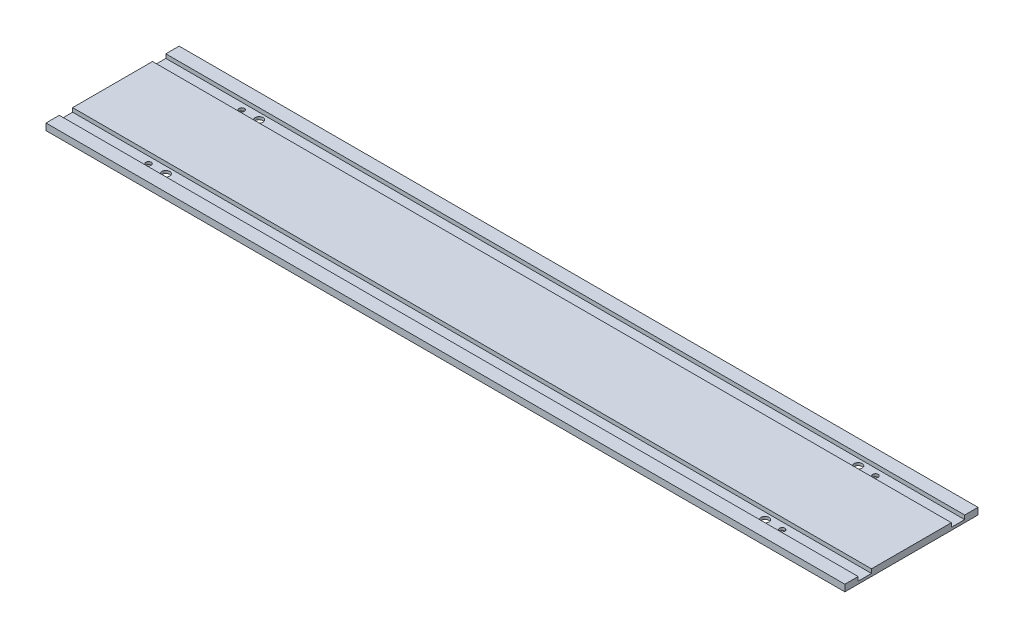
ISO-10303-21;
HEADER;
FILE_DESCRIPTION(('STEP AP214'),'2;1');
FILE_NAME('part.step','',(''),(''),'','','');
FILE_SCHEMA(('AUTOMOTIVE_DESIGN { 1 0 10303 214 1 1 1 1 }'));
ENDSEC;
DATA;
#1=APPLICATION_CONTEXT('core data for automotive mechanical design processes');
#2=APPLICATION_PROTOCOL_DEFINITION('international standard','automotive_design',2000,#1);
#3=PRODUCT_CONTEXT('',#1,'mechanical');
#4=PRODUCT('Part','Part','',(#3));
#5=PRODUCT_RELATED_PRODUCT_CATEGORY('part','',(#4));
#6=PRODUCT_DEFINITION_FORMATION('','',#4);
#7=PRODUCT_DEFINITION_CONTEXT('part definition',#1,'design');
#8=PRODUCT_DEFINITION('design','',#6,#7);
#9=PRODUCT_DEFINITION_SHAPE('','',#8);
#10=(LENGTH_UNIT() NAMED_UNIT(*) SI_UNIT(.MILLI.,.METRE.));
#11=(NAMED_UNIT(*) PLANE_ANGLE_UNIT() SI_UNIT($,.RADIAN.));
#12=(NAMED_UNIT(*) SI_UNIT($,.STERADIAN.) SOLID_ANGLE_UNIT());
#13=UNCERTAINTY_MEASURE_WITH_UNIT(LENGTH_MEASURE(1.E-05),#10,'distance_accuracy_value','');
#14=(GEOMETRIC_REPRESENTATION_CONTEXT(3) GLOBAL_UNCERTAINTY_ASSIGNED_CONTEXT((#13)) GLOBAL_UNIT_ASSIGNED_CONTEXT((#10,
#11,#12)) REPRESENTATION_CONTEXT('',''));
#15=CARTESIAN_POINT('',(0.,0.,0.));
#16=DIRECTION('',(0.,0.,1.));
#17=DIRECTION('',(1.,0.,0.));
#18=AXIS2_PLACEMENT_3D('',#15,#16,#17);
#19=CARTESIAN_POINT('',(600.,5.,-100.));
#20=DIRECTION('',(0.,1.,0.));
#21=DIRECTION('',(-1.,0.,0.));
#22=AXIS2_PLACEMENT_3D('',#19,#20,#21);
#23=PLANE('',#22);
#24=DIRECTION('',(1.,0.,0.));
#25=VECTOR('',#24,1.);
#26=CARTESIAN_POINT('',(0.,4.99999999999994,-80.));
#27=LINE('',#26,#25);
#28=CARTESIAN_POINT('',(0.,4.99999999999994,-80.));
#29=VERTEX_POINT('',#28);
#30=CARTESIAN_POINT('',(600.,5.,-80.));
#31=VERTEX_POINT('',#30);
#32=EDGE_CURVE('E149',#29,#31,#27,.T.);
#33=ORIENTED_EDGE('',*,*,#32,.F.);
#34=DIRECTION('',(0.,0.,1.));
#35=VECTOR('',#34,1.);
#36=CARTESIAN_POINT('',(0.,4.99999999999994,-100.));
#37=LINE('',#36,#35);
#38=CARTESIAN_POINT('',(0.,4.99999999999994,-20.));
#39=VERTEX_POINT('',#38);
#40=EDGE_CURVE('E48',#29,#39,#37,.T.);
#41=ORIENTED_EDGE('',*,*,#40,.T.);
#42=DIRECTION('',(-1.,0.,0.));
#43=VECTOR('',#42,1.);
#44=CARTESIAN_POINT('',(0.,4.99999999999994,-20.));
#45=LINE('',#44,#43);
#46=CARTESIAN_POINT('',(600.,5.,-20.));
#47=VERTEX_POINT('',#46);
#48=EDGE_CURVE('E178',#47,#39,#45,.T.);
#49=ORIENTED_EDGE('',*,*,#48,.F.);
#50=DIRECTION('',(0.,0.,1.));
#51=VECTOR('',#50,1.);
#52=CARTESIAN_POINT('',(600.,5.,-100.));
#53=LINE('',#52,#51);
#54=EDGE_CURVE('E233',#31,#47,#53,.T.);
#55=ORIENTED_EDGE('',*,*,#54,.F.);
#56=EDGE_LOOP('',(#33,#41,#49,#55));
#57=FACE_BOUND('',#56,.T.);
#58=ADVANCED_FACE('F38',(#57),#23,.T.);
#59=DIRECTION('',(-1.,0.,0.));
#60=VECTOR('',#59,1.);
#61=CARTESIAN_POINT('',(0.,4.99999999999994,-90.));
#62=LINE('',#61,#60);
#63=CARTESIAN_POINT('',(600.,5.,-90.));
#64=VERTEX_POINT('',#63);
#65=CARTESIAN_POINT('',(0.,4.99999999999994,-90.));
#66=VERTEX_POINT('',#65);
#67=EDGE_CURVE('E187',#64,#66,#62,.T.);
#68=ORIENTED_EDGE('',*,*,#67,.F.);
#69=CARTESIAN_POINT('',(600.,5.,-100.));
#70=VERTEX_POINT('',#69);
#71=EDGE_CURVE('E154',#70,#64,#53,.T.);
#72=ORIENTED_EDGE('',*,*,#71,.F.);
#73=DIRECTION('',(-1.,0.,0.));
#74=VECTOR('',#73,1.);
#75=CARTESIAN_POINT('',(600.,5.,-100.));
#76=LINE('',#75,#74);
#77=CARTESIAN_POINT('',(0.,4.99999999999994,-100.));
#78=VERTEX_POINT('',#77);
#79=EDGE_CURVE('E210',#70,#78,#76,.T.);
#80=ORIENTED_EDGE('',*,*,#79,.T.);
#81=EDGE_CURVE('E11',#78,#66,#37,.T.);
#82=ORIENTED_EDGE('',*,*,#81,.T.);
#83=EDGE_LOOP('',(#68,#72,#80,#82));
#84=FACE_BOUND('',#83,.T.);
#85=ADVANCED_FACE('F347',(#84),#23,.T.);
#86=CARTESIAN_POINT('',(0.,4.99999999999994,-100.));
#87=DIRECTION('',(-1.,0.,0.));
#88=DIRECTION('',(0.,-1.,0.));
#89=AXIS2_PLACEMENT_3D('',#86,#87,#88);
#90=PLANE('',#89);
#91=DIRECTION('',(0.,1.,0.));
#92=VECTOR('',#91,1.);
#93=CARTESIAN_POINT('',(0.,1.99999999999993,-80.));
#94=LINE('',#93,#92);
#95=CARTESIAN_POINT('',(0.,1.99999999999993,-80.));
#96=VERTEX_POINT('',#95);
#97=EDGE_CURVE('E159',#96,#29,#94,.T.);
#98=ORIENTED_EDGE('',*,*,#97,.F.);
#99=DIRECTION('',(0.,0.,1.));
#100=VECTOR('',#99,1.);
#101=CARTESIAN_POINT('',(0.,1.99999999999993,-90.));
#102=LINE('',#101,#100);
#103=CARTESIAN_POINT('',(0.,1.99999999999993,-90.));
#104=VERTEX_POINT('',#103);
#105=EDGE_CURVE('E141',#104,#96,#102,.T.);
#106=ORIENTED_EDGE('',*,*,#105,.F.);
#107=DIRECTION('',(0.,1.,0.));
#108=VECTOR('',#107,1.);
#109=CARTESIAN_POINT('',(0.,1.99999999999993,-90.));
#110=LINE('',#109,#108);
#111=EDGE_CURVE('E138',#104,#66,#110,.T.);
#112=ORIENTED_EDGE('',*,*,#111,.T.);
#113=ORIENTED_EDGE('',*,*,#81,.F.);
#114=DIRECTION('',(0.,-1.,0.));
#115=VECTOR('',#114,1.);
#116=CARTESIAN_POINT('',(0.,4.99999999999994,-100.));
#117=LINE('',#116,#115);
#118=CARTESIAN_POINT('',(0.,0.,-100.));
#119=VERTEX_POINT('',#118);
#120=EDGE_CURVE('E198',#78,#119,#117,.T.);
#121=ORIENTED_EDGE('',*,*,#120,.T.);
#122=DIRECTION('',(0.,0.,1.));
#123=VECTOR('',#122,1.);
#124=CARTESIAN_POINT('',(0.,0.,-100.));
#125=LINE('',#124,#123);
#126=CARTESIAN_POINT('',(0.,0.,0.));
#127=VERTEX_POINT('',#126);
#128=EDGE_CURVE('E214',#119,#127,#125,.T.);
#129=ORIENTED_EDGE('',*,*,#128,.T.);
#130=DIRECTION('',(0.,-1.,0.));
#131=VECTOR('',#130,1.);
#132=CARTESIAN_POINT('',(0.,4.99999999999994,0.));
#133=LINE('',#132,#131);
#134=CARTESIAN_POINT('',(0.,4.99999999999994,0.));
#135=VERTEX_POINT('',#134);
#136=EDGE_CURVE('E215',#135,#127,#133,.T.);
#137=ORIENTED_EDGE('',*,*,#136,.F.);
#138=CARTESIAN_POINT('',(0.,4.99999999999994,-10.));
#139=VERTEX_POINT('',#138);
#140=EDGE_CURVE('E50',#139,#135,#37,.T.);
#141=ORIENTED_EDGE('',*,*,#140,.F.);
#142=DIRECTION('',(0.,1.,0.));
#143=VECTOR('',#142,1.);
#144=CARTESIAN_POINT('',(0.,1.99999999999993,-10.));
#145=LINE('',#144,#143);
#146=CARTESIAN_POINT('',(0.,1.99999999999993,-10.));
#147=VERTEX_POINT('',#146);
#148=EDGE_CURVE('E192',#147,#139,#145,.T.);
#149=ORIENTED_EDGE('',*,*,#148,.F.);
#150=DIRECTION('',(0.,0.,1.));
#151=VECTOR('',#150,1.);
#152=CARTESIAN_POINT('',(0.,1.99999999999993,-20.));
#153=LINE('',#152,#151);
#154=CARTESIAN_POINT('',(0.,1.99999999999993,-20.));
#155=VERTEX_POINT('',#154);
#156=EDGE_CURVE('E168',#155,#147,#153,.T.);
#157=ORIENTED_EDGE('',*,*,#156,.F.);
#158=DIRECTION('',(0.,1.,0.));
#159=VECTOR('',#158,1.);
#160=CARTESIAN_POINT('',(0.,1.99999999999993,-20.));
#161=LINE('',#160,#159);
#162=EDGE_CURVE('E177',#155,#39,#161,.T.);
#163=ORIENTED_EDGE('',*,*,#162,.T.);
#164=ORIENTED_EDGE('',*,*,#40,.F.);
#165=EDGE_LOOP('',(#98,#106,#112,#113,#121,#129,#137,#141,#149,#157,#163,#164));
#166=FACE_BOUND('',#165,.T.);
#167=ADVANCED_FACE('F40',(#166),#90,.T.);
#168=DIRECTION('',(1.,0.,0.));
#169=VECTOR('',#168,1.);
#170=CARTESIAN_POINT('',(0.,4.99999999999994,-10.));
#171=LINE('',#170,#169);
#172=CARTESIAN_POINT('',(600.,5.,-10.));
#173=VERTEX_POINT('',#172);
#174=EDGE_CURVE('E169',#139,#173,#171,.T.);
#175=ORIENTED_EDGE('',*,*,#174,.F.);
#176=ORIENTED_EDGE('',*,*,#140,.T.);
#177=DIRECTION('',(-1.,0.,0.));
#178=VECTOR('',#177,1.);
#179=CARTESIAN_POINT('',(600.,5.,0.));
#180=LINE('',#179,#178);
#181=CARTESIAN_POINT('',(600.,5.,0.));
#182=VERTEX_POINT('',#181);
#183=EDGE_CURVE('E203',#182,#135,#180,.T.);
#184=ORIENTED_EDGE('',*,*,#183,.F.);
#185=EDGE_CURVE('E234',#173,#182,#53,.T.);
#186=ORIENTED_EDGE('',*,*,#185,.F.);
#187=EDGE_LOOP('',(#175,#176,#184,#186));
#188=FACE_BOUND('',#187,.T.);
#189=ADVANCED_FACE('F320',(#188),#23,.T.);
#190=CARTESIAN_POINT('',(600.,0.,-100.));
#191=DIRECTION('',(1.,0.,0.));
#192=DIRECTION('',(0.,0.,-1.));
#193=AXIS2_PLACEMENT_3D('',#190,#191,#192);
#194=PLANE('',#193);
#195=DIRECTION('',(0.,1.,0.));
#196=VECTOR('',#195,1.);
#197=CARTESIAN_POINT('',(600.,2.,-80.));
#198=LINE('',#197,#196);
#199=CARTESIAN_POINT('',(600.,2.,-80.));
#200=VERTEX_POINT('',#199);
#201=EDGE_CURVE('E220',#200,#31,#198,.T.);
#202=ORIENTED_EDGE('',*,*,#201,.T.);
#203=ORIENTED_EDGE('',*,*,#54,.T.);
#204=DIRECTION('',(0.,1.,0.));
#205=VECTOR('',#204,1.);
#206=CARTESIAN_POINT('',(600.,2.,-20.));
#207=LINE('',#206,#205);
#208=CARTESIAN_POINT('',(600.,2.,-20.));
#209=VERTEX_POINT('',#208);
#210=EDGE_CURVE('E184',#209,#47,#207,.T.);
#211=ORIENTED_EDGE('',*,*,#210,.F.);
#212=DIRECTION('',(0.,0.,-1.));
#213=VECTOR('',#212,1.);
#214=CARTESIAN_POINT('',(600.,2.,-20.));
#215=LINE('',#214,#213);
#216=CARTESIAN_POINT('',(600.,2.,-9.99999999999999));
#217=VERTEX_POINT('',#216);
#218=EDGE_CURVE('E174',#217,#209,#215,.T.);
#219=ORIENTED_EDGE('',*,*,#218,.F.);
#220=DIRECTION('',(0.,1.,0.));
#221=VECTOR('',#220,1.);
#222=CARTESIAN_POINT('',(600.,2.,-10.));
#223=LINE('',#222,#221);
#224=EDGE_CURVE('E188',#217,#173,#223,.T.);
#225=ORIENTED_EDGE('',*,*,#224,.T.);
#226=ORIENTED_EDGE('',*,*,#185,.T.);
#227=DIRECTION('',(0.,1.,0.));
#228=VECTOR('',#227,1.);
#229=CARTESIAN_POINT('',(600.,0.,0.));
#230=LINE('',#229,#228);
#231=CARTESIAN_POINT('',(600.,0.,0.));
#232=VERTEX_POINT('',#231);
#233=EDGE_CURVE('E224',#232,#182,#230,.T.);
#234=ORIENTED_EDGE('',*,*,#233,.F.);
#235=DIRECTION('',(0.,0.,1.));
#236=VECTOR('',#235,1.);
#237=CARTESIAN_POINT('',(600.,0.,-100.));
#238=LINE('',#237,#236);
#239=CARTESIAN_POINT('',(600.,0.,-100.));
#240=VERTEX_POINT('',#239);
#241=EDGE_CURVE('E235',#240,#232,#238,.T.);
#242=ORIENTED_EDGE('',*,*,#241,.F.);
#243=DIRECTION('',(0.,1.,0.));
#244=VECTOR('',#243,1.);
#245=CARTESIAN_POINT('',(600.,0.,-100.));
#246=LINE('',#245,#244);
#247=EDGE_CURVE('E207',#240,#70,#246,.T.);
#248=ORIENTED_EDGE('',*,*,#247,.T.);
#249=ORIENTED_EDGE('',*,*,#71,.T.);
#250=DIRECTION('',(0.,1.,0.));
#251=VECTOR('',#250,1.);
#252=CARTESIAN_POINT('',(600.,2.,-90.));
#253=LINE('',#252,#251);
#254=CARTESIAN_POINT('',(600.,2.,-90.));
#255=VERTEX_POINT('',#254);
#256=EDGE_CURVE('E135',#255,#64,#253,.T.);
#257=ORIENTED_EDGE('',*,*,#256,.F.);
#258=DIRECTION('',(0.,0.,-1.));
#259=VECTOR('',#258,1.);
#260=CARTESIAN_POINT('',(600.,2.,-90.));
#261=LINE('',#260,#259);
#262=EDGE_CURVE('E142',#200,#255,#261,.T.);
#263=ORIENTED_EDGE('',*,*,#262,.F.);
#264=EDGE_LOOP('',(#202,#203,#211,#219,#225,#226,#234,#242,#248,#249,#257,#263));
#265=FACE_BOUND('',#264,.T.);
#266=ADVANCED_FACE('F152',(#265),#194,.T.);
#267=CARTESIAN_POINT('',(0.,0.,-100.));
#268=DIRECTION('',(0.,-1.,0.));
#269=DIRECTION('',(0.,0.,-1.));
#270=AXIS2_PLACEMENT_3D('',#267,#268,#269);
#271=PLANE('',#270);
#272=CARTESIAN_POINT('',(74.9999999999999,-1.17093834628434E-13,-15.));
#273=DIRECTION('',(0.,1.,0.));
#274=DIRECTION('',(-1.,0.,0.));
#275=AXIS2_PLACEMENT_3D('',#272,#273,#274);
#276=CIRCLE('',#275,3.00000000000001);
#277=CARTESIAN_POINT('',(71.9999999999999,-1.1742343208887E-13,-15.));
#278=VERTEX_POINT('',#277);
#279=EDGE_CURVE('E544',#278,#278,#276,.T.);
#280=ORIENTED_EDGE('',*,*,#279,.T.);
#281=EDGE_LOOP('',(#280));
#282=FACE_BOUND('',#281,.T.);
#283=CARTESIAN_POINT('',(525.,0.,-85.));
#284=DIRECTION('',(0.,1.,0.));
#285=DIRECTION('',(-1.,0.,0.));
#286=AXIS2_PLACEMENT_3D('',#283,#284,#285);
#287=CIRCLE('',#286,3.00000000000005);
#288=CARTESIAN_POINT('',(522.,0.,-85.));
#289=VERTEX_POINT('',#288);
#290=EDGE_CURVE('E547',#289,#289,#287,.T.);
#291=ORIENTED_EDGE('',*,*,#290,.T.);
#292=EDGE_LOOP('',(#291));
#293=FACE_BOUND('',#292,.T.);
#294=CARTESIAN_POINT('',(525.,0.,-15.));
#295=DIRECTION('',(0.,1.,0.));
#296=DIRECTION('',(-1.,0.,0.));
#297=AXIS2_PLACEMENT_3D('',#294,#295,#296);
#298=CIRCLE('',#297,3.00000000000005);
#299=CARTESIAN_POINT('',(522.,0.,-15.));
#300=VERTEX_POINT('',#299);
#301=EDGE_CURVE('E551',#300,#300,#298,.T.);
#302=ORIENTED_EDGE('',*,*,#301,.T.);
#303=EDGE_LOOP('',(#302));
#304=FACE_BOUND('',#303,.T.);
#305=CARTESIAN_POINT('',(74.9999999999999,-1.17093834628434E-13,-85.));
#306=DIRECTION('',(0.,1.,0.));
#307=DIRECTION('',(-1.,0.,0.));
#308=AXIS2_PLACEMENT_3D('',#305,#306,#307);
#309=CIRCLE('',#308,3.00000000000001);
#310=CARTESIAN_POINT('',(71.9999999999999,-1.1742343208887E-13,-85.));
#311=VERTEX_POINT('',#310);
#312=EDGE_CURVE('E261',#311,#311,#309,.T.);
#313=ORIENTED_EDGE('',*,*,#312,.T.);
#314=EDGE_LOOP('',(#313));
#315=FACE_BOUND('',#314,.T.);
#316=CARTESIAN_POINT('',(62.,0.,-15.));
#317=DIRECTION('',(0.,1.,0.));
#318=DIRECTION('',(-1.,0.,0.));
#319=AXIS2_PLACEMENT_3D('',#316,#317,#318);
#320=CIRCLE('',#319,2.);
#321=CARTESIAN_POINT('',(60.,0.,-15.));
#322=VERTEX_POINT('',#321);
#323=EDGE_CURVE('E282',#322,#322,#320,.T.);
#324=ORIENTED_EDGE('',*,*,#323,.T.);
#325=EDGE_LOOP('',(#324));
#326=FACE_BOUND('',#325,.T.);
#327=CARTESIAN_POINT('',(538.,0.,-85.));
#328=DIRECTION('',(0.,1.,0.));
#329=DIRECTION('',(-1.,0.,0.));
#330=AXIS2_PLACEMENT_3D('',#327,#328,#329);
#331=CIRCLE('',#330,2.);
#332=CARTESIAN_POINT('',(536.,0.,-85.));
#333=VERTEX_POINT('',#332);
#334=EDGE_CURVE('E276',#333,#333,#331,.T.);
#335=ORIENTED_EDGE('',*,*,#334,.T.);
#336=EDGE_LOOP('',(#335));
#337=FACE_BOUND('',#336,.T.);
#338=CARTESIAN_POINT('',(538.,0.,-15.));
#339=DIRECTION('',(0.,1.,0.));
#340=DIRECTION('',(-1.,0.,0.));
#341=AXIS2_PLACEMENT_3D('',#338,#339,#340);
#342=CIRCLE('',#341,2.);
#343=CARTESIAN_POINT('',(536.,0.,-15.));
#344=VERTEX_POINT('',#343);
#345=EDGE_CURVE('E271',#344,#344,#342,.T.);
#346=ORIENTED_EDGE('',*,*,#345,.T.);
#347=EDGE_LOOP('',(#346));
#348=FACE_BOUND('',#347,.T.);
#349=CARTESIAN_POINT('',(61.9999999999999,0.,-85.));
#350=DIRECTION('',(0.,1.,0.));
#351=DIRECTION('',(-1.,0.,0.));
#352=AXIS2_PLACEMENT_3D('',#349,#350,#351);
#353=CIRCLE('',#352,2.);
#354=CARTESIAN_POINT('',(59.9999999999999,0.,-85.));
#355=VERTEX_POINT('',#354);
#356=EDGE_CURVE('E245',#355,#355,#353,.T.);
#357=ORIENTED_EDGE('',*,*,#356,.T.);
#358=EDGE_LOOP('',(#357));
#359=FACE_BOUND('',#358,.T.);
#360=DIRECTION('',(1.,0.,0.));
#361=VECTOR('',#360,1.);
#362=CARTESIAN_POINT('',(0.,0.,0.));
#363=LINE('',#362,#361);
#364=EDGE_CURVE('E219',#127,#232,#363,.T.);
#365=ORIENTED_EDGE('',*,*,#364,.F.);
#366=ORIENTED_EDGE('',*,*,#128,.F.);
#367=DIRECTION('',(1.,0.,0.));
#368=VECTOR('',#367,1.);
#369=CARTESIAN_POINT('',(0.,0.,-100.));
#370=LINE('',#369,#368);
#371=EDGE_CURVE('E202',#119,#240,#370,.T.);
#372=ORIENTED_EDGE('',*,*,#371,.T.);
#373=ORIENTED_EDGE('',*,*,#241,.T.);
#374=EDGE_LOOP('',(#365,#366,#372,#373));
#375=FACE_BOUND('',#374,.T.);
#376=ADVANCED_FACE('F360',(#282,#293,#304,#315,#326,#337,#348,#359,#375),#271,.T.);
#377=CARTESIAN_POINT('',(0.,0.,-100.));
#378=DIRECTION('',(0.,0.,1.));
#379=DIRECTION('',(1.,0.,0.));
#380=AXIS2_PLACEMENT_3D('',#377,#378,#379);
#381=PLANE('',#380);
#382=ORIENTED_EDGE('',*,*,#120,.F.);
#383=ORIENTED_EDGE('',*,*,#79,.F.);
#384=ORIENTED_EDGE('',*,*,#247,.F.);
#385=ORIENTED_EDGE('',*,*,#371,.F.);
#386=EDGE_LOOP('',(#382,#383,#384,#385));
#387=FACE_BOUND('',#386,.T.);
#388=ADVANCED_FACE('F381',(#387),#381,.F.);
#389=CARTESIAN_POINT('',(0.,0.,0.));
#390=DIRECTION('',(0.,0.,1.));
#391=DIRECTION('',(1.,0.,0.));
#392=AXIS2_PLACEMENT_3D('',#389,#390,#391);
#393=PLANE('',#392);
#394=ORIENTED_EDGE('',*,*,#136,.T.);
#395=ORIENTED_EDGE('',*,*,#364,.T.);
#396=ORIENTED_EDGE('',*,*,#233,.T.);
#397=ORIENTED_EDGE('',*,*,#183,.T.);
#398=EDGE_LOOP('',(#394,#395,#396,#397));
#399=FACE_BOUND('',#398,.T.);
#400=ADVANCED_FACE('F325',(#399),#393,.T.);
#401=CARTESIAN_POINT('',(0.,1.99999999999993,-20.));
#402=DIRECTION('',(0.,0.,-1.));
#403=DIRECTION('',(-1.,0.,0.));
#404=AXIS2_PLACEMENT_3D('',#401,#402,#403);
#405=PLANE('',#404);
#406=ORIENTED_EDGE('',*,*,#48,.T.);
#407=ORIENTED_EDGE('',*,*,#162,.F.);
#408=DIRECTION('',(-1.,0.,0.));
#409=VECTOR('',#408,1.);
#410=CARTESIAN_POINT('',(0.,1.99999999999993,-20.));
#411=LINE('',#410,#409);
#412=EDGE_CURVE('E164',#209,#155,#411,.T.);
#413=ORIENTED_EDGE('',*,*,#412,.F.);
#414=ORIENTED_EDGE('',*,*,#210,.T.);
#415=EDGE_LOOP('',(#406,#407,#413,#414));
#416=FACE_BOUND('',#415,.T.);
#417=ADVANCED_FACE('F333',(#416),#405,.F.);
#418=CARTESIAN_POINT('',(0.,1.99999999999993,-10.));
#419=DIRECTION('',(0.,0.,1.));
#420=DIRECTION('',(1.,0.,0.));
#421=AXIS2_PLACEMENT_3D('',#418,#419,#420);
#422=PLANE('',#421);
#423=ORIENTED_EDGE('',*,*,#174,.T.);
#424=ORIENTED_EDGE('',*,*,#224,.F.);
#425=DIRECTION('',(1.,0.,0.));
#426=VECTOR('',#425,1.);
#427=CARTESIAN_POINT('',(0.,1.99999999999993,-10.));
#428=LINE('',#427,#426);
#429=EDGE_CURVE('E65',#147,#217,#428,.T.);
#430=ORIENTED_EDGE('',*,*,#429,.F.);
#431=ORIENTED_EDGE('',*,*,#148,.T.);
#432=EDGE_LOOP('',(#423,#424,#430,#431));
#433=FACE_BOUND('',#432,.T.);
#434=ADVANCED_FACE('F336',(#433),#422,.F.);
#435=CARTESIAN_POINT('',(0.,1.99999999999993,0.));
#436=DIRECTION('',(0.,-1.,0.));
#437=DIRECTION('',(1.,0.,0.));
#438=AXIS2_PLACEMENT_3D('',#435,#436,#437);
#439=PLANE('',#438);
#440=CARTESIAN_POINT('',(74.9999999999999,1.99999999999994,-15.));
#441=DIRECTION('',(0.,-1.,0.));
#442=DIRECTION('',(1.,0.,0.));
#443=AXIS2_PLACEMENT_3D('',#440,#441,#442);
#444=CIRCLE('',#443,3.00000000000001);
#445=CARTESIAN_POINT('',(77.9999999999999,1.99999999999994,-15.));
#446=VERTEX_POINT('',#445);
#447=EDGE_CURVE('E42',#446,#446,#444,.T.);
#448=ORIENTED_EDGE('',*,*,#447,.T.);
#449=EDGE_LOOP('',(#448));
#450=FACE_BOUND('',#449,.T.);
#451=CARTESIAN_POINT('',(525.,1.99999999999999,-15.));
#452=DIRECTION('',(0.,-1.,0.));
#453=DIRECTION('',(1.,0.,0.));
#454=AXIS2_PLACEMENT_3D('',#451,#452,#453);
#455=CIRCLE('',#454,3.00000000000005);
#456=CARTESIAN_POINT('',(528.,1.99999999999999,-15.));
#457=VERTEX_POINT('',#456);
#458=EDGE_CURVE('E264',#457,#457,#455,.T.);
#459=ORIENTED_EDGE('',*,*,#458,.T.);
#460=EDGE_LOOP('',(#459));
#461=FACE_BOUND('',#460,.T.);
#462=CARTESIAN_POINT('',(62.,1.99999999999994,-15.));
#463=DIRECTION('',(0.,-1.,0.));
#464=DIRECTION('',(1.,0.,0.));
#465=AXIS2_PLACEMENT_3D('',#462,#463,#464);
#466=CIRCLE('',#465,2.);
#467=CARTESIAN_POINT('',(64.,1.99999999999994,-15.));
#468=VERTEX_POINT('',#467);
#469=EDGE_CURVE('E181',#468,#468,#466,.T.);
#470=ORIENTED_EDGE('',*,*,#469,.T.);
#471=EDGE_LOOP('',(#470));
#472=FACE_BOUND('',#471,.T.);
#473=CARTESIAN_POINT('',(538.,1.99999999999999,-15.));
#474=DIRECTION('',(0.,-1.,0.));
#475=DIRECTION('',(1.,0.,0.));
#476=AXIS2_PLACEMENT_3D('',#473,#474,#475);
#477=CIRCLE('',#476,2.);
#478=CARTESIAN_POINT('',(540.,1.99999999999999,-15.));
#479=VERTEX_POINT('',#478);
#480=EDGE_CURVE('E249',#479,#479,#477,.T.);
#481=ORIENTED_EDGE('',*,*,#480,.T.);
#482=EDGE_LOOP('',(#481));
#483=FACE_BOUND('',#482,.T.);
#484=ORIENTED_EDGE('',*,*,#412,.T.);
#485=ORIENTED_EDGE('',*,*,#156,.T.);
#486=ORIENTED_EDGE('',*,*,#429,.T.);
#487=ORIENTED_EDGE('',*,*,#218,.T.);
#488=EDGE_LOOP('',(#484,#485,#486,#487));
#489=FACE_BOUND('',#488,.T.);
#490=ADVANCED_FACE('F334',(#450,#461,#472,#483,#489),#439,.F.);
#491=CARTESIAN_POINT('',(0.,1.99999999999993,-80.));
#492=DIRECTION('',(0.,0.,1.));
#493=DIRECTION('',(1.,0.,0.));
#494=AXIS2_PLACEMENT_3D('',#491,#492,#493);
#495=PLANE('',#494);
#496=ORIENTED_EDGE('',*,*,#32,.T.);
#497=ORIENTED_EDGE('',*,*,#201,.F.);
#498=DIRECTION('',(1.,0.,0.));
#499=VECTOR('',#498,1.);
#500=CARTESIAN_POINT('',(0.,1.99999999999993,-80.));
#501=LINE('',#500,#499);
#502=EDGE_CURVE('E57',#96,#200,#501,.T.);
#503=ORIENTED_EDGE('',*,*,#502,.F.);
#504=ORIENTED_EDGE('',*,*,#97,.T.);
#505=EDGE_LOOP('',(#496,#497,#503,#504));
#506=FACE_BOUND('',#505,.T.);
#507=ADVANCED_FACE('F304',(#506),#495,.F.);
#508=CARTESIAN_POINT('',(0.,1.99999999999993,-90.));
#509=DIRECTION('',(0.,0.,-1.));
#510=DIRECTION('',(-1.,0.,0.));
#511=AXIS2_PLACEMENT_3D('',#508,#509,#510);
#512=PLANE('',#511);
#513=ORIENTED_EDGE('',*,*,#67,.T.);
#514=ORIENTED_EDGE('',*,*,#111,.F.);
#515=DIRECTION('',(-1.,0.,0.));
#516=VECTOR('',#515,1.);
#517=CARTESIAN_POINT('',(0.,1.99999999999993,-90.));
#518=LINE('',#517,#516);
#519=EDGE_CURVE('E132',#255,#104,#518,.T.);
#520=ORIENTED_EDGE('',*,*,#519,.F.);
#521=ORIENTED_EDGE('',*,*,#256,.T.);
#522=EDGE_LOOP('',(#513,#514,#520,#521));
#523=FACE_BOUND('',#522,.T.);
#524=ADVANCED_FACE('F133',(#523),#512,.F.);
#525=CARTESIAN_POINT('',(0.,1.99999999999993,0.));
#526=DIRECTION('',(0.,1.,0.));
#527=DIRECTION('',(-1.,0.,0.));
#528=AXIS2_PLACEMENT_3D('',#525,#526,#527);
#529=PLANE('',#528);
#530=CARTESIAN_POINT('',(525.,1.99999999999999,-85.));
#531=DIRECTION('',(0.,1.,0.));
#532=DIRECTION('',(-1.,0.,0.));
#533=AXIS2_PLACEMENT_3D('',#530,#531,#532);
#534=CIRCLE('',#533,3.00000000000005);
#535=CARTESIAN_POINT('',(522.,1.99999999999999,-85.));
#536=VERTEX_POINT('',#535);
#537=EDGE_CURVE('E260',#536,#536,#534,.T.);
#538=ORIENTED_EDGE('',*,*,#537,.F.);
#539=EDGE_LOOP('',(#538));
#540=FACE_BOUND('',#539,.T.);
#541=CARTESIAN_POINT('',(74.9999999999999,1.99999999999994,-85.));
#542=DIRECTION('',(0.,1.,0.));
#543=DIRECTION('',(-1.,0.,0.));
#544=AXIS2_PLACEMENT_3D('',#541,#542,#543);
#545=CIRCLE('',#544,3.00000000000001);
#546=CARTESIAN_POINT('',(71.9999999999999,1.99999999999994,-85.));
#547=VERTEX_POINT('',#546);
#548=EDGE_CURVE('E256',#547,#547,#545,.T.);
#549=ORIENTED_EDGE('',*,*,#548,.F.);
#550=EDGE_LOOP('',(#549));
#551=FACE_BOUND('',#550,.T.);
#552=CARTESIAN_POINT('',(538.,1.99999999999999,-85.));
#553=DIRECTION('',(0.,1.,0.));
#554=DIRECTION('',(-1.,0.,0.));
#555=AXIS2_PLACEMENT_3D('',#552,#553,#554);
#556=CIRCLE('',#555,2.);
#557=CARTESIAN_POINT('',(536.,1.99999999999999,-85.));
#558=VERTEX_POINT('',#557);
#559=EDGE_CURVE('E244',#558,#558,#556,.T.);
#560=ORIENTED_EDGE('',*,*,#559,.F.);
#561=EDGE_LOOP('',(#560));
#562=FACE_BOUND('',#561,.T.);
#563=CARTESIAN_POINT('',(61.9999999999999,1.99999999999994,-85.));
#564=DIRECTION('',(0.,1.,0.));
#565=DIRECTION('',(-1.,0.,0.));
#566=AXIS2_PLACEMENT_3D('',#563,#564,#565);
#567=CIRCLE('',#566,2.);
#568=CARTESIAN_POINT('',(59.9999999999999,1.99999999999994,-85.));
#569=VERTEX_POINT('',#568);
#570=EDGE_CURVE('E240',#569,#569,#567,.T.);
#571=ORIENTED_EDGE('',*,*,#570,.F.);
#572=EDGE_LOOP('',(#571));
#573=FACE_BOUND('',#572,.T.);
#574=ORIENTED_EDGE('',*,*,#262,.T.);
#575=ORIENTED_EDGE('',*,*,#519,.T.);
#576=ORIENTED_EDGE('',*,*,#105,.T.);
#577=ORIENTED_EDGE('',*,*,#502,.T.);
#578=EDGE_LOOP('',(#574,#575,#576,#577));
#579=FACE_BOUND('',#578,.T.);
#580=ADVANCED_FACE('F145',(#540,#551,#562,#573,#579),#529,.T.);
#581=CARTESIAN_POINT('',(61.9999999999999,0.,-85.));
#582=DIRECTION('',(0.,1.,0.));
#583=DIRECTION('',(-1.,0.,0.));
#584=AXIS2_PLACEMENT_3D('',#581,#582,#583);
#585=CYLINDRICAL_SURFACE('',#584,2.);
#586=ORIENTED_EDGE('',*,*,#570,.T.);
#587=EDGE_LOOP('',(#586));
#588=FACE_BOUND('',#587,.T.);
#589=ORIENTED_EDGE('',*,*,#356,.F.);
#590=EDGE_LOOP('',(#589));
#591=FACE_BOUND('',#590,.T.);
#592=ADVANCED_FACE('F438',(#588,#591),#585,.F.);
#593=CARTESIAN_POINT('',(538.,0.,-85.));
#594=DIRECTION('',(0.,1.,0.));
#595=DIRECTION('',(-1.,0.,0.));
#596=AXIS2_PLACEMENT_3D('',#593,#594,#595);
#597=CYLINDRICAL_SURFACE('',#596,2.);
#598=ORIENTED_EDGE('',*,*,#559,.T.);
#599=EDGE_LOOP('',(#598));
#600=FACE_BOUND('',#599,.T.);
#601=ORIENTED_EDGE('',*,*,#334,.F.);
#602=EDGE_LOOP('',(#601));
#603=FACE_BOUND('',#602,.T.);
#604=ADVANCED_FACE('F443',(#600,#603),#597,.F.);
#605=CARTESIAN_POINT('',(538.,0.,-15.));
#606=DIRECTION('',(0.,1.,0.));
#607=DIRECTION('',(-1.,0.,0.));
#608=AXIS2_PLACEMENT_3D('',#605,#606,#607);
#609=CYLINDRICAL_SURFACE('',#608,2.);
#610=ORIENTED_EDGE('',*,*,#345,.F.);
#611=EDGE_LOOP('',(#610));
#612=FACE_BOUND('',#611,.T.);
#613=ORIENTED_EDGE('',*,*,#480,.F.);
#614=EDGE_LOOP('',(#613));
#615=FACE_BOUND('',#614,.T.);
#616=ADVANCED_FACE('F453',(#612,#615),#609,.F.);
#617=CARTESIAN_POINT('',(62.,0.,-15.));
#618=DIRECTION('',(0.,1.,0.));
#619=DIRECTION('',(-1.,0.,0.));
#620=AXIS2_PLACEMENT_3D('',#617,#618,#619);
#621=CYLINDRICAL_SURFACE('',#620,2.);
#622=ORIENTED_EDGE('',*,*,#323,.F.);
#623=EDGE_LOOP('',(#622));
#624=FACE_BOUND('',#623,.T.);
#625=ORIENTED_EDGE('',*,*,#469,.F.);
#626=EDGE_LOOP('',(#625));
#627=FACE_BOUND('',#626,.T.);
#628=ADVANCED_FACE('F462',(#624,#627),#621,.F.);
#629=CARTESIAN_POINT('',(74.9999999999999,-1.17093834628434E-13,-85.));
#630=DIRECTION('',(0.,1.,0.));
#631=DIRECTION('',(-1.,0.,0.));
#632=AXIS2_PLACEMENT_3D('',#629,#630,#631);
#633=CYLINDRICAL_SURFACE('',#632,3.00000000000001);
#634=ORIENTED_EDGE('',*,*,#548,.T.);
#635=EDGE_LOOP('',(#634));
#636=FACE_BOUND('',#635,.T.);
#637=ORIENTED_EDGE('',*,*,#312,.F.);
#638=EDGE_LOOP('',(#637));
#639=FACE_BOUND('',#638,.T.);
#640=ADVANCED_FACE('F471',(#636,#639),#633,.F.);
#641=CARTESIAN_POINT('',(525.,0.,-85.));
#642=DIRECTION('',(0.,1.,0.));
#643=DIRECTION('',(-1.,0.,0.));
#644=AXIS2_PLACEMENT_3D('',#641,#642,#643);
#645=CYLINDRICAL_SURFACE('',#644,3.00000000000005);
#646=ORIENTED_EDGE('',*,*,#537,.T.);
#647=EDGE_LOOP('',(#646));
#648=FACE_BOUND('',#647,.T.);
#649=ORIENTED_EDGE('',*,*,#290,.F.);
#650=EDGE_LOOP('',(#649));
#651=FACE_BOUND('',#650,.T.);
#652=ADVANCED_FACE('F482',(#648,#651),#645,.F.);
#653=CARTESIAN_POINT('',(525.,0.,-15.));
#654=DIRECTION('',(0.,1.,0.));
#655=DIRECTION('',(-1.,0.,0.));
#656=AXIS2_PLACEMENT_3D('',#653,#654,#655);
#657=CYLINDRICAL_SURFACE('',#656,3.00000000000005);
#658=ORIENTED_EDGE('',*,*,#301,.F.);
#659=EDGE_LOOP('',(#658));
#660=FACE_BOUND('',#659,.T.);
#661=ORIENTED_EDGE('',*,*,#458,.F.);
#662=EDGE_LOOP('',(#661));
#663=FACE_BOUND('',#662,.T.);
#664=ADVANCED_FACE('F490',(#660,#663),#657,.F.);
#665=CARTESIAN_POINT('',(74.9999999999999,-1.17093834628434E-13,-15.));
#666=DIRECTION('',(0.,1.,0.));
#667=DIRECTION('',(-1.,0.,0.));
#668=AXIS2_PLACEMENT_3D('',#665,#666,#667);
#669=CYLINDRICAL_SURFACE('',#668,3.00000000000001);
#670=ORIENTED_EDGE('',*,*,#279,.F.);
#671=EDGE_LOOP('',(#670));
#672=FACE_BOUND('',#671,.T.);
#673=ORIENTED_EDGE('',*,*,#447,.F.);
#674=EDGE_LOOP('',(#673));
#675=FACE_BOUND('',#674,.T.);
#676=ADVANCED_FACE('F498',(#672,#675),#669,.F.);
#677=CLOSED_SHELL('',(#58,#85,#167,#189,#266,#376,#388,#400,#417,#434,#490,#507,#524,#580,#592,
#604,#616,#628,#640,#652,#664,#676));
#678=MANIFOLD_SOLID_BREP('B2',#677);
#679=ADVANCED_BREP_SHAPE_REPRESENTATION('',(#18,#678),#14);
#680=SHAPE_DEFINITION_REPRESENTATION(#9,#679);
ENDSEC;
END-ISO-10303-21;
